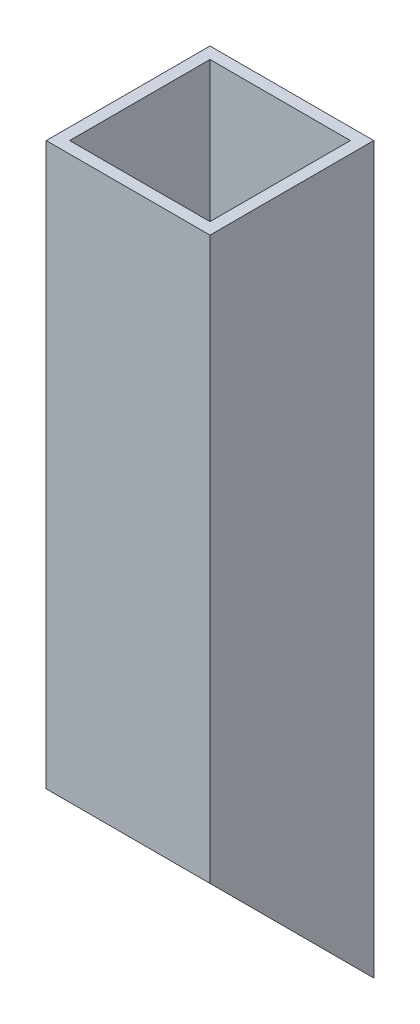
ISO-10303-21;
HEADER;
FILE_DESCRIPTION(('STEP AP214'),'2;1');
FILE_NAME('part.step','',(''),(''),'','','');
FILE_SCHEMA(('AUTOMOTIVE_DESIGN { 1 0 10303 214 1 1 1 1 }'));
ENDSEC;
DATA;
#1=APPLICATION_CONTEXT('core data for automotive mechanical design processes');
#2=APPLICATION_PROTOCOL_DEFINITION('international standard','automotive_design',2000,#1);
#3=PRODUCT_CONTEXT('',#1,'mechanical');
#4=PRODUCT('Part','Part','',(#3));
#5=PRODUCT_RELATED_PRODUCT_CATEGORY('part','',(#4));
#6=PRODUCT_DEFINITION_FORMATION('','',#4);
#7=PRODUCT_DEFINITION_CONTEXT('part definition',#1,'design');
#8=PRODUCT_DEFINITION('design','',#6,#7);
#9=PRODUCT_DEFINITION_SHAPE('','',#8);
#10=(LENGTH_UNIT() NAMED_UNIT(*) SI_UNIT(.MILLI.,.METRE.));
#11=(NAMED_UNIT(*) PLANE_ANGLE_UNIT() SI_UNIT($,.RADIAN.));
#12=(NAMED_UNIT(*) SI_UNIT($,.STERADIAN.) SOLID_ANGLE_UNIT());
#13=UNCERTAINTY_MEASURE_WITH_UNIT(LENGTH_MEASURE(1.E-05),#10,'distance_accuracy_value','');
#14=(GEOMETRIC_REPRESENTATION_CONTEXT(3) GLOBAL_UNCERTAINTY_ASSIGNED_CONTEXT((#13)) GLOBAL_UNIT_ASSIGNED_CONTEXT((#10,
#11,#12)) REPRESENTATION_CONTEXT('',''));
#15=CARTESIAN_POINT('',(0.,0.,0.));
#16=DIRECTION('',(0.,0.,1.));
#17=DIRECTION('',(1.,0.,0.));
#18=AXIS2_PLACEMENT_3D('',#15,#16,#17);
#19=CARTESIAN_POINT('',(3.13984949151802E-13,196.85,0.));
#20=DIRECTION('',(0.,-1.,0.));
#21=DIRECTION('',(0.,0.,-1.));
#22=AXIS2_PLACEMENT_3D('',#19,#20,#21);
#23=PLANE('',#22);
#24=DIRECTION('',(0.,0.,1.));
#25=VECTOR('',#24,1.);
#26=CARTESIAN_POINT('',(3.13984949151802E-13,196.85,0.));
#27=LINE('',#26,#25);
#28=CARTESIAN_POINT('',(3.13984949151802E-13,196.85,-44.45));
#29=VERTEX_POINT('',#28);
#30=CARTESIAN_POINT('',(3.13984949151802E-13,196.85,0.));
#31=VERTEX_POINT('',#30);
#32=EDGE_CURVE('E126',#29,#31,#27,.T.);
#33=ORIENTED_EDGE('',*,*,#32,.T.);
#34=DIRECTION('',(1.,0.,0.));
#35=VECTOR('',#34,1.);
#36=CARTESIAN_POINT('',(3.13984949151802E-13,196.85,0.));
#37=LINE('',#36,#35);
#38=CARTESIAN_POINT('',(44.4500000000003,196.85,0.));
#39=VERTEX_POINT('',#38);
#40=EDGE_CURVE('E132',#31,#39,#37,.T.);
#41=ORIENTED_EDGE('',*,*,#40,.T.);
#42=DIRECTION('',(0.,0.,-1.));
#43=VECTOR('',#42,1.);
#44=CARTESIAN_POINT('',(44.4500000000003,196.85,0.));
#45=LINE('',#44,#43);
#46=CARTESIAN_POINT('',(44.4500000000003,196.85,-44.45));
#47=VERTEX_POINT('',#46);
#48=EDGE_CURVE('E129',#39,#47,#45,.T.);
#49=ORIENTED_EDGE('',*,*,#48,.T.);
#50=DIRECTION('',(-1.,0.,0.));
#51=VECTOR('',#50,1.);
#52=CARTESIAN_POINT('',(3.13984949151802E-13,196.85,-44.45));
#53=LINE('',#52,#51);
#54=EDGE_CURVE('E123',#47,#29,#53,.T.);
#55=ORIENTED_EDGE('',*,*,#54,.T.);
#56=EDGE_LOOP('',(#33,#41,#49,#55));
#57=FACE_BOUND('',#56,.T.);
#58=DIRECTION('',(1.,0.,0.));
#59=VECTOR('',#58,1.);
#60=CARTESIAN_POINT('',(3.17500000000032,196.85,-3.175));
#61=LINE('',#60,#59);
#62=CARTESIAN_POINT('',(3.17500000000032,196.85,-3.175));
#63=VERTEX_POINT('',#62);
#64=CARTESIAN_POINT('',(41.2750000000003,196.85,-3.1749999999998));
#65=VERTEX_POINT('',#64);
#66=EDGE_CURVE('E94',#63,#65,#61,.T.);
#67=ORIENTED_EDGE('',*,*,#66,.F.);
#68=DIRECTION('',(0.,0.,1.));
#69=VECTOR('',#68,1.);
#70=CARTESIAN_POINT('',(3.17500000000032,196.85,-3.175));
#71=LINE('',#70,#69);
#72=CARTESIAN_POINT('',(3.17500000000031,196.85,-41.275));
#73=VERTEX_POINT('',#72);
#74=EDGE_CURVE('E142',#73,#63,#71,.T.);
#75=ORIENTED_EDGE('',*,*,#74,.F.);
#76=DIRECTION('',(-1.,0.,0.));
#77=VECTOR('',#76,1.);
#78=CARTESIAN_POINT('',(3.17500000000031,196.85,-41.275));
#79=LINE('',#78,#77);
#80=CARTESIAN_POINT('',(41.2750000000002,196.85,-41.275));
#81=VERTEX_POINT('',#80);
#82=EDGE_CURVE('E145',#81,#73,#79,.T.);
#83=ORIENTED_EDGE('',*,*,#82,.F.);
#84=DIRECTION('',(0.,0.,-1.));
#85=VECTOR('',#84,1.);
#86=CARTESIAN_POINT('',(41.2750000000003,196.85,-3.1749999999998));
#87=LINE('',#86,#85);
#88=EDGE_CURVE('E104',#65,#81,#87,.T.);
#89=ORIENTED_EDGE('',*,*,#88,.F.);
#90=EDGE_LOOP('',(#67,#75,#83,#89));
#91=FACE_BOUND('',#90,.T.);
#92=ADVANCED_FACE('F39',(#57,#91),#23,.F.);
#93=CARTESIAN_POINT('',(3.13984949151802E-13,196.85,0.));
#94=DIRECTION('',(1.,0.,0.));
#95=DIRECTION('',(0.,0.,-1.));
#96=AXIS2_PLACEMENT_3D('',#93,#94,#95);
#97=PLANE('',#96);
#98=DIRECTION('',(0.,-1.,0.));
#99=VECTOR('',#98,1.);
#100=CARTESIAN_POINT('',(3.13984949151802E-13,196.85,-44.45));
#101=LINE('',#100,#99);
#102=CARTESIAN_POINT('',(0.,0.,-44.45));
#103=VERTEX_POINT('',#102);
#104=EDGE_CURVE('E121',#29,#103,#101,.T.);
#105=ORIENTED_EDGE('',*,*,#104,.T.);
#106=DIRECTION('',(0.,0.707106781186546,0.707106781186549));
#107=VECTOR('',#106,1.);
#108=CARTESIAN_POINT('',(1.02348685082632E-13,44.45,0.));
#109=LINE('',#108,#107);
#110=CARTESIAN_POINT('',(1.02348685082632E-13,44.45,0.));
#111=VERTEX_POINT('',#110);
#112=EDGE_CURVE('E11',#103,#111,#109,.T.);
#113=ORIENTED_EDGE('',*,*,#112,.T.);
#114=DIRECTION('',(0.,-1.,0.));
#115=VECTOR('',#114,1.);
#116=CARTESIAN_POINT('',(3.13984949151802E-13,196.85,0.));
#117=LINE('',#116,#115);
#118=EDGE_CURVE('E113',#31,#111,#117,.T.);
#119=ORIENTED_EDGE('',*,*,#118,.F.);
#120=ORIENTED_EDGE('',*,*,#32,.F.);
#121=EDGE_LOOP('',(#105,#113,#119,#120));
#122=FACE_BOUND('',#121,.T.);
#123=ADVANCED_FACE('F179',(#122),#97,.F.);
#124=CARTESIAN_POINT('',(3.13984949151802E-13,196.85,0.));
#125=DIRECTION('',(0.,0.,-1.));
#126=DIRECTION('',(-1.,0.,0.));
#127=AXIS2_PLACEMENT_3D('',#124,#125,#126);
#128=PLANE('',#127);
#129=ORIENTED_EDGE('',*,*,#118,.T.);
#130=DIRECTION('',(1.,0.,0.));
#131=VECTOR('',#130,1.);
#132=CARTESIAN_POINT('',(44.4500000000001,44.4500000000001,0.));
#133=LINE('',#132,#131);
#134=CARTESIAN_POINT('',(44.4500000000001,44.4500000000001,0.));
#135=VERTEX_POINT('',#134);
#136=EDGE_CURVE('E110',#111,#135,#133,.T.);
#137=ORIENTED_EDGE('',*,*,#136,.T.);
#138=DIRECTION('',(0.,-1.,0.));
#139=VECTOR('',#138,1.);
#140=CARTESIAN_POINT('',(44.4500000000003,196.85,0.));
#141=LINE('',#140,#139);
#142=EDGE_CURVE('E115',#39,#135,#141,.T.);
#143=ORIENTED_EDGE('',*,*,#142,.F.);
#144=ORIENTED_EDGE('',*,*,#40,.F.);
#145=EDGE_LOOP('',(#129,#137,#143,#144));
#146=FACE_BOUND('',#145,.T.);
#147=ADVANCED_FACE('F183',(#146),#128,.F.);
#148=CARTESIAN_POINT('',(44.4500000000003,196.85,0.));
#149=DIRECTION('',(-1.,0.,0.));
#150=DIRECTION('',(0.,0.,1.));
#151=AXIS2_PLACEMENT_3D('',#148,#149,#150);
#152=PLANE('',#151);
#153=ORIENTED_EDGE('',*,*,#142,.T.);
#154=DIRECTION('',(0.,-0.707106781186546,-0.707106781186549));
#155=VECTOR('',#154,1.);
#156=CARTESIAN_POINT('',(44.4500000000001,44.4500000000001,0.));
#157=LINE('',#156,#155);
#158=CARTESIAN_POINT('',(44.45,2.08166817117217E-13,-44.45));
#159=VERTEX_POINT('',#158);
#160=EDGE_CURVE('E49',#135,#159,#157,.T.);
#161=ORIENTED_EDGE('',*,*,#160,.T.);
#162=DIRECTION('',(0.,-1.,0.));
#163=VECTOR('',#162,1.);
#164=CARTESIAN_POINT('',(44.4500000000003,196.85,-44.45));
#165=LINE('',#164,#163);
#166=EDGE_CURVE('E118',#47,#159,#165,.T.);
#167=ORIENTED_EDGE('',*,*,#166,.F.);
#168=ORIENTED_EDGE('',*,*,#48,.F.);
#169=EDGE_LOOP('',(#153,#161,#167,#168));
#170=FACE_BOUND('',#169,.T.);
#171=ADVANCED_FACE('F186',(#170),#152,.F.);
#172=CARTESIAN_POINT('',(3.13984949151802E-13,196.85,-44.45));
#173=DIRECTION('',(0.,0.,1.));
#174=DIRECTION('',(1.,0.,0.));
#175=AXIS2_PLACEMENT_3D('',#172,#173,#174);
#176=PLANE('',#175);
#177=DIRECTION('',(-1.,0.,0.));
#178=VECTOR('',#177,1.);
#179=CARTESIAN_POINT('',(0.,0.,-44.45));
#180=LINE('',#179,#178);
#181=EDGE_CURVE('E95',#159,#103,#180,.T.);
#182=ORIENTED_EDGE('',*,*,#181,.T.);
#183=ORIENTED_EDGE('',*,*,#104,.F.);
#184=ORIENTED_EDGE('',*,*,#54,.F.);
#185=ORIENTED_EDGE('',*,*,#166,.T.);
#186=EDGE_LOOP('',(#182,#183,#184,#185));
#187=FACE_BOUND('',#186,.T.);
#188=ADVANCED_FACE('F174',(#187),#176,.F.);
#189=CARTESIAN_POINT('',(3.17500000000032,196.85,-3.175));
#190=DIRECTION('',(0.,0.,-1.));
#191=DIRECTION('',(-1.,0.,0.));
#192=AXIS2_PLACEMENT_3D('',#189,#190,#191);
#193=PLANE('',#192);
#194=DIRECTION('',(1.,0.,0.));
#195=VECTOR('',#194,1.);
#196=CARTESIAN_POINT('',(1.02348685082632E-13,41.275,-3.175));
#197=LINE('',#196,#195);
#198=CARTESIAN_POINT('',(3.1750000000001,41.275,-3.175));
#199=VERTEX_POINT('',#198);
#200=CARTESIAN_POINT('',(41.2750000000001,41.2750000000001,-3.1749999999998));
#201=VERTEX_POINT('',#200);
#202=EDGE_CURVE('E43',#199,#201,#197,.T.);
#203=ORIENTED_EDGE('',*,*,#202,.F.);
#204=DIRECTION('',(0.,-1.,0.));
#205=VECTOR('',#204,1.);
#206=CARTESIAN_POINT('',(3.17500000000032,196.85,-3.175));
#207=LINE('',#206,#205);
#208=EDGE_CURVE('E140',#63,#199,#207,.T.);
#209=ORIENTED_EDGE('',*,*,#208,.F.);
#210=ORIENTED_EDGE('',*,*,#66,.T.);
#211=DIRECTION('',(0.,-1.,0.));
#212=VECTOR('',#211,1.);
#213=CARTESIAN_POINT('',(41.2750000000003,196.85,-3.1749999999998));
#214=LINE('',#213,#212);
#215=EDGE_CURVE('E78',#65,#201,#214,.T.);
#216=ORIENTED_EDGE('',*,*,#215,.T.);
#217=EDGE_LOOP('',(#203,#209,#210,#216));
#218=FACE_BOUND('',#217,.T.);
#219=ADVANCED_FACE('F90',(#218),#193,.T.);
#220=CARTESIAN_POINT('',(41.2750000000003,196.85,-3.1749999999998));
#221=DIRECTION('',(-1.,0.,0.));
#222=DIRECTION('',(0.,0.,1.));
#223=AXIS2_PLACEMENT_3D('',#220,#221,#222);
#224=PLANE('',#223);
#225=DIRECTION('',(0.,-0.707106781186546,-0.707106781186549));
#226=VECTOR('',#225,1.);
#227=CARTESIAN_POINT('',(41.2750000000001,44.4500000000001,1.94289029309402E-13));
#228=LINE('',#227,#226);
#229=CARTESIAN_POINT('',(41.2749999999999,3.17500000000018,-41.275));
#230=VERTEX_POINT('',#229);
#231=EDGE_CURVE('E74',#201,#230,#228,.T.);
#232=ORIENTED_EDGE('',*,*,#231,.F.);
#233=ORIENTED_EDGE('',*,*,#215,.F.);
#234=ORIENTED_EDGE('',*,*,#88,.T.);
#235=DIRECTION('',(0.,-1.,0.));
#236=VECTOR('',#235,1.);
#237=CARTESIAN_POINT('',(41.2750000000002,196.85,-41.275));
#238=LINE('',#237,#236);
#239=EDGE_CURVE('E81',#81,#230,#238,.T.);
#240=ORIENTED_EDGE('',*,*,#239,.T.);
#241=EDGE_LOOP('',(#232,#233,#234,#240));
#242=FACE_BOUND('',#241,.T.);
#243=ADVANCED_FACE('F76',(#242),#224,.T.);
#244=CARTESIAN_POINT('',(3.17500000000031,196.85,-41.275));
#245=DIRECTION('',(0.,0.,1.));
#246=DIRECTION('',(1.,0.,0.));
#247=AXIS2_PLACEMENT_3D('',#244,#245,#246);
#248=PLANE('',#247);
#249=DIRECTION('',(-1.,0.,0.));
#250=VECTOR('',#249,1.);
#251=CARTESIAN_POINT('',(0.,3.17500000000015,-41.275));
#252=LINE('',#251,#250);
#253=CARTESIAN_POINT('',(3.175,3.17500000000018,-41.275));
#254=VERTEX_POINT('',#253);
#255=EDGE_CURVE('E86',#230,#254,#252,.T.);
#256=ORIENTED_EDGE('',*,*,#255,.F.);
#257=ORIENTED_EDGE('',*,*,#239,.F.);
#258=ORIENTED_EDGE('',*,*,#82,.T.);
#259=DIRECTION('',(0.,-1.,0.));
#260=VECTOR('',#259,1.);
#261=CARTESIAN_POINT('',(3.17500000000031,196.85,-41.275));
#262=LINE('',#261,#260);
#263=EDGE_CURVE('E138',#73,#254,#262,.T.);
#264=ORIENTED_EDGE('',*,*,#263,.T.);
#265=EDGE_LOOP('',(#256,#257,#258,#264));
#266=FACE_BOUND('',#265,.T.);
#267=ADVANCED_FACE('F154',(#266),#248,.T.);
#268=CARTESIAN_POINT('',(3.17500000000032,196.85,-3.175));
#269=DIRECTION('',(1.,0.,0.));
#270=DIRECTION('',(0.,0.,-1.));
#271=AXIS2_PLACEMENT_3D('',#268,#269,#270);
#272=PLANE('',#271);
#273=DIRECTION('',(0.,0.707106781186546,0.707106781186549));
#274=VECTOR('',#273,1.);
#275=CARTESIAN_POINT('',(3.17500000000009,44.45,0.));
#276=LINE('',#275,#274);
#277=EDGE_CURVE('E99',#254,#199,#276,.T.);
#278=ORIENTED_EDGE('',*,*,#277,.F.);
#279=ORIENTED_EDGE('',*,*,#263,.F.);
#280=ORIENTED_EDGE('',*,*,#74,.T.);
#281=ORIENTED_EDGE('',*,*,#208,.T.);
#282=EDGE_LOOP('',(#278,#279,#280,#281));
#283=FACE_BOUND('',#282,.T.);
#284=ADVANCED_FACE('F156',(#283),#272,.T.);
#285=CARTESIAN_POINT('',(1.02348685082632E-13,44.45,0.));
#286=DIRECTION('',(0.,-0.707106781186549,0.707106781186546));
#287=DIRECTION('',(-1.,0.,0.));
#288=AXIS2_PLACEMENT_3D('',#285,#286,#287);
#289=PLANE('',#288);
#290=ORIENTED_EDGE('',*,*,#112,.F.);
#291=ORIENTED_EDGE('',*,*,#181,.F.);
#292=ORIENTED_EDGE('',*,*,#160,.F.);
#293=ORIENTED_EDGE('',*,*,#136,.F.);
#294=EDGE_LOOP('',(#290,#291,#292,#293));
#295=FACE_BOUND('',#294,.T.);
#296=ORIENTED_EDGE('',*,*,#277,.T.);
#297=ORIENTED_EDGE('',*,*,#202,.T.);
#298=ORIENTED_EDGE('',*,*,#231,.T.);
#299=ORIENTED_EDGE('',*,*,#255,.T.);
#300=EDGE_LOOP('',(#296,#297,#298,#299));
#301=FACE_BOUND('',#300,.T.);
#302=ADVANCED_FACE('F41',(#295,#301),#289,.T.);
#303=CLOSED_SHELL('',(#92,#123,#147,#171,#188,#219,#243,#267,#284,#302));
#304=MANIFOLD_SOLID_BREP('B2',#303);
#305=ADVANCED_BREP_SHAPE_REPRESENTATION('',(#18,#304),#14);
#306=SHAPE_DEFINITION_REPRESENTATION(#9,#305);
ENDSEC;
END-ISO-10303-21;
